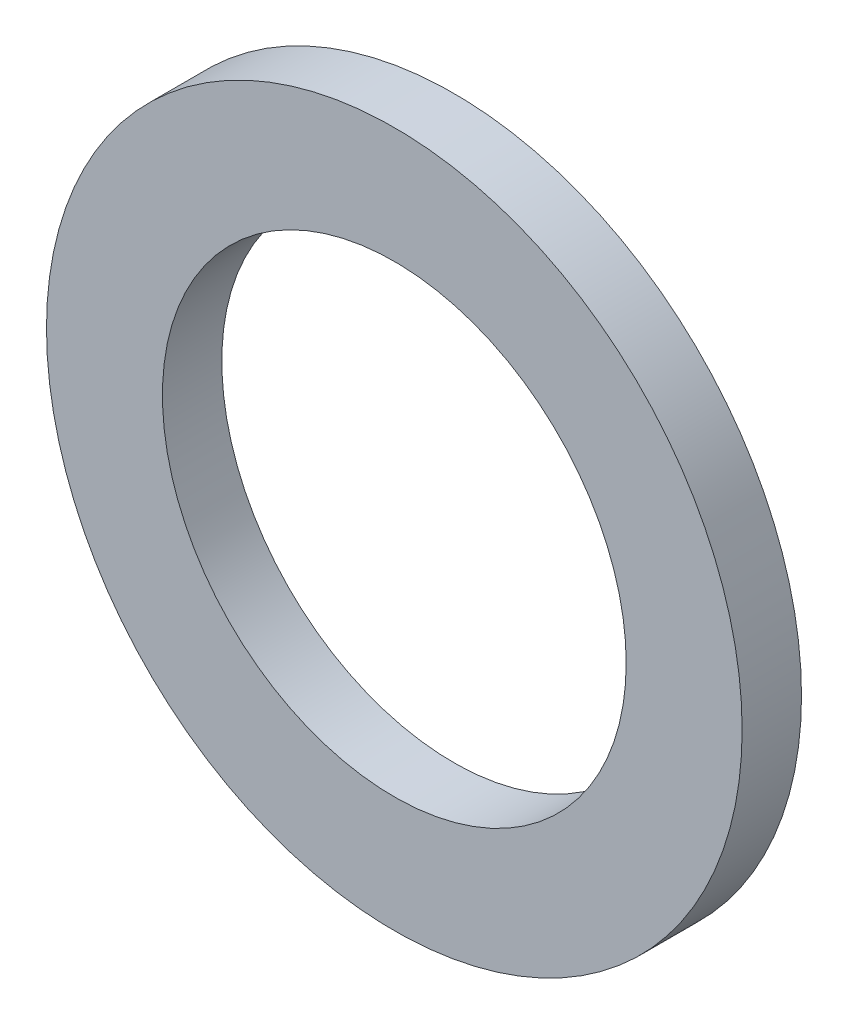
ISO-10303-21;
HEADER;
FILE_DESCRIPTION(('STEP AP214'),'2;1');
FILE_NAME('part.step','',(''),(''),'','','');
FILE_SCHEMA(('AUTOMOTIVE_DESIGN { 1 0 10303 214 1 1 1 1 }'));
ENDSEC;
DATA;
#1=APPLICATION_CONTEXT('core data for automotive mechanical design processes');
#2=APPLICATION_PROTOCOL_DEFINITION('international standard','automotive_design',2000,#1);
#3=PRODUCT_CONTEXT('',#1,'mechanical');
#4=PRODUCT('Part','Part','',(#3));
#5=PRODUCT_RELATED_PRODUCT_CATEGORY('part','',(#4));
#6=PRODUCT_DEFINITION_FORMATION('','',#4);
#7=PRODUCT_DEFINITION_CONTEXT('part definition',#1,'design');
#8=PRODUCT_DEFINITION('design','',#6,#7);
#9=PRODUCT_DEFINITION_SHAPE('','',#8);
#10=(LENGTH_UNIT() NAMED_UNIT(*) SI_UNIT(.MILLI.,.METRE.));
#11=(NAMED_UNIT(*) PLANE_ANGLE_UNIT() SI_UNIT($,.RADIAN.));
#12=(NAMED_UNIT(*) SI_UNIT($,.STERADIAN.) SOLID_ANGLE_UNIT());
#13=UNCERTAINTY_MEASURE_WITH_UNIT(LENGTH_MEASURE(1.E-05),#10,'distance_accuracy_value','');
#14=(GEOMETRIC_REPRESENTATION_CONTEXT(3) GLOBAL_UNCERTAINTY_ASSIGNED_CONTEXT((#13)) GLOBAL_UNIT_ASSIGNED_CONTEXT((#10,
#11,#12)) REPRESENTATION_CONTEXT('',''));
#15=CARTESIAN_POINT('',(0.,0.,0.));
#16=DIRECTION('',(0.,0.,1.));
#17=DIRECTION('',(1.,0.,0.));
#18=AXIS2_PLACEMENT_3D('',#15,#16,#17);
#19=CARTESIAN_POINT('',(0.,0.,0.8128));
#20=DIRECTION('',(0.,0.,1.));
#21=DIRECTION('',(1.,0.,0.));
#22=AXIS2_PLACEMENT_3D('',#19,#20,#21);
#23=PLANE('',#22);
#24=CARTESIAN_POINT('',(0.,0.,0.8128));
#25=DIRECTION('',(0.,0.,1.));
#26=DIRECTION('',(1.,0.,0.));
#27=AXIS2_PLACEMENT_3D('',#24,#25,#26);
#28=CIRCLE('',#27,4.7625);
#29=CARTESIAN_POINT('',(4.7625,0.,0.8128));
#30=VERTEX_POINT('',#29);
#31=EDGE_CURVE('E10',#30,#30,#28,.T.);
#32=ORIENTED_EDGE('',*,*,#31,.T.);
#33=EDGE_LOOP('',(#32));
#34=FACE_BOUND('',#33,.T.);
#35=CARTESIAN_POINT('',(0.,0.,0.8128));
#36=DIRECTION('',(0.,0.,1.));
#37=DIRECTION('',(1.,0.,0.));
#38=AXIS2_PLACEMENT_3D('',#35,#36,#37);
#39=CIRCLE('',#38,3.175);
#40=CARTESIAN_POINT('',(3.175,0.,0.8128));
#41=VERTEX_POINT('',#40);
#42=EDGE_CURVE('E44',#41,#41,#39,.T.);
#43=ORIENTED_EDGE('',*,*,#42,.F.);
#44=EDGE_LOOP('',(#43));
#45=FACE_BOUND('',#44,.T.);
#46=ADVANCED_FACE('F33',(#34,#45),#23,.T.);
#47=CARTESIAN_POINT('',(0.,0.,0.));
#48=DIRECTION('',(0.,0.,1.));
#49=DIRECTION('',(1.,0.,0.));
#50=AXIS2_PLACEMENT_3D('',#47,#48,#49);
#51=PLANE('',#50);
#52=CARTESIAN_POINT('',(0.,0.,0.));
#53=DIRECTION('',(0.,0.,1.));
#54=DIRECTION('',(1.,0.,0.));
#55=AXIS2_PLACEMENT_3D('',#52,#53,#54);
#56=CIRCLE('',#55,4.7625);
#57=CARTESIAN_POINT('',(4.7625,0.,0.));
#58=VERTEX_POINT('',#57);
#59=EDGE_CURVE('E37',#58,#58,#56,.T.);
#60=ORIENTED_EDGE('',*,*,#59,.F.);
#61=EDGE_LOOP('',(#60));
#62=FACE_BOUND('',#61,.T.);
#63=CARTESIAN_POINT('',(0.,0.,0.));
#64=DIRECTION('',(0.,0.,1.));
#65=DIRECTION('',(1.,0.,0.));
#66=AXIS2_PLACEMENT_3D('',#63,#64,#65);
#67=CIRCLE('',#66,3.175);
#68=CARTESIAN_POINT('',(3.175,0.,0.));
#69=VERTEX_POINT('',#68);
#70=EDGE_CURVE('E46',#69,#69,#67,.T.);
#71=ORIENTED_EDGE('',*,*,#70,.T.);
#72=EDGE_LOOP('',(#71));
#73=FACE_BOUND('',#72,.T.);
#74=ADVANCED_FACE('F56',(#62,#73),#51,.F.);
#75=CARTESIAN_POINT('',(0.,0.,0.8128));
#76=DIRECTION('',(0.,0.,-1.));
#77=DIRECTION('',(-1.,0.,0.));
#78=AXIS2_PLACEMENT_3D('',#75,#76,#77);
#79=CYLINDRICAL_SURFACE('',#78,4.7625);
#80=ORIENTED_EDGE('',*,*,#31,.F.);
#81=EDGE_LOOP('',(#80));
#82=FACE_BOUND('',#81,.T.);
#83=ORIENTED_EDGE('',*,*,#59,.T.);
#84=EDGE_LOOP('',(#83));
#85=FACE_BOUND('',#84,.T.);
#86=ADVANCED_FACE('F35',(#82,#85),#79,.T.);
#87=CARTESIAN_POINT('',(0.,0.,0.8128));
#88=DIRECTION('',(0.,0.,-1.));
#89=DIRECTION('',(-1.,0.,0.));
#90=AXIS2_PLACEMENT_3D('',#87,#88,#89);
#91=CYLINDRICAL_SURFACE('',#90,3.175);
#92=ORIENTED_EDGE('',*,*,#42,.T.);
#93=EDGE_LOOP('',(#92));
#94=FACE_BOUND('',#93,.T.);
#95=ORIENTED_EDGE('',*,*,#70,.F.);
#96=EDGE_LOOP('',(#95));
#97=FACE_BOUND('',#96,.T.);
#98=ADVANCED_FACE('F52',(#94,#97),#91,.F.);
#99=CLOSED_SHELL('',(#46,#74,#86,#98));
#100=MANIFOLD_SOLID_BREP('B2',#99);
#101=ADVANCED_BREP_SHAPE_REPRESENTATION('',(#18,#100),#14);
#102=SHAPE_DEFINITION_REPRESENTATION(#9,#101);
ENDSEC;
END-ISO-10303-21;
